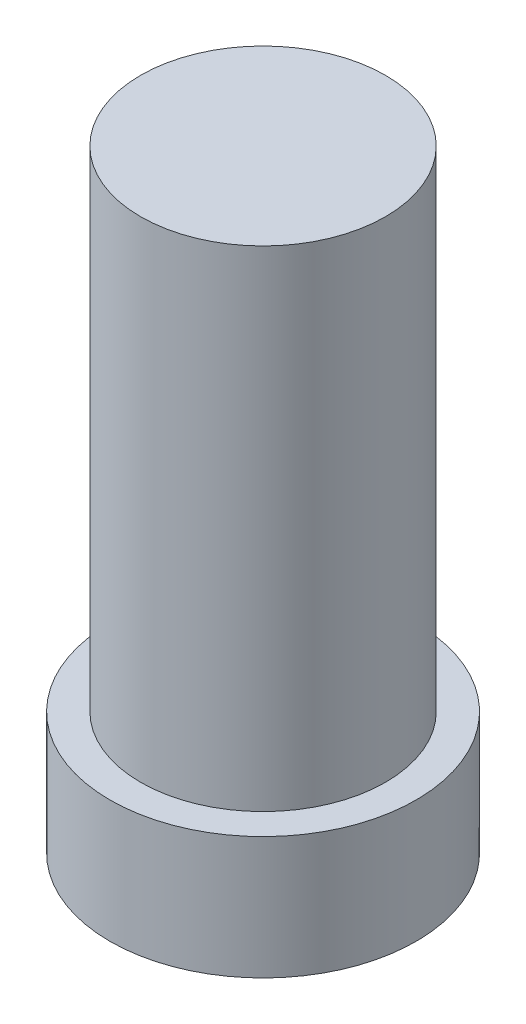
ISO-10303-21;
HEADER;
FILE_DESCRIPTION(('STEP AP214'),'2;1');
FILE_NAME('part.step','',(''),(''),'','','');
FILE_SCHEMA(('AUTOMOTIVE_DESIGN { 1 0 10303 214 1 1 1 1 }'));
ENDSEC;
DATA;
#1=APPLICATION_CONTEXT('core data for automotive mechanical design processes');
#2=APPLICATION_PROTOCOL_DEFINITION('international standard','automotive_design',2000,#1);
#3=PRODUCT_CONTEXT('',#1,'mechanical');
#4=PRODUCT('Part','Part','',(#3));
#5=PRODUCT_RELATED_PRODUCT_CATEGORY('part','',(#4));
#6=PRODUCT_DEFINITION_FORMATION('','',#4);
#7=PRODUCT_DEFINITION_CONTEXT('part definition',#1,'design');
#8=PRODUCT_DEFINITION('design','',#6,#7);
#9=PRODUCT_DEFINITION_SHAPE('','',#8);
#10=(LENGTH_UNIT() NAMED_UNIT(*) SI_UNIT(.MILLI.,.METRE.));
#11=(NAMED_UNIT(*) PLANE_ANGLE_UNIT() SI_UNIT($,.RADIAN.));
#12=(NAMED_UNIT(*) SI_UNIT($,.STERADIAN.) SOLID_ANGLE_UNIT());
#13=UNCERTAINTY_MEASURE_WITH_UNIT(LENGTH_MEASURE(1.E-05),#10,'distance_accuracy_value','');
#14=(GEOMETRIC_REPRESENTATION_CONTEXT(3) GLOBAL_UNCERTAINTY_ASSIGNED_CONTEXT((#13)) GLOBAL_UNIT_ASSIGNED_CONTEXT((#10,
#11,#12)) REPRESENTATION_CONTEXT('',''));
#15=CARTESIAN_POINT('',(0.,0.,0.));
#16=DIRECTION('',(0.,0.,1.));
#17=DIRECTION('',(1.,0.,0.));
#18=AXIS2_PLACEMENT_3D('',#15,#16,#17);
#19=CARTESIAN_POINT('',(0.,4.01151685393258,0.));
#20=DIRECTION('',(0.,-1.,0.));
#21=DIRECTION('',(0.,0.,-1.));
#22=AXIS2_PLACEMENT_3D('',#19,#20,#21);
#23=CYLINDRICAL_SURFACE('',#22,0.5625);
#24=CARTESIAN_POINT('',(0.,4.01151685393258,0.));
#25=DIRECTION('',(0.,1.,0.));
#26=DIRECTION('',(0.,0.,1.));
#27=AXIS2_PLACEMENT_3D('',#24,#25,#26);
#28=CIRCLE('',#27,0.5625);
#29=CARTESIAN_POINT('',(0.,4.01151685393258,0.5625));
#30=VERTEX_POINT('',#29);
#31=EDGE_CURVE('E46',#30,#30,#28,.T.);
#32=ORIENTED_EDGE('',*,*,#31,.F.);
#33=EDGE_LOOP('',(#32));
#34=FACE_BOUND('',#33,.T.);
#35=CARTESIAN_POINT('',(0.,3.56151685393258,0.));
#36=DIRECTION('',(0.,1.,0.));
#37=DIRECTION('',(0.,0.,1.));
#38=AXIS2_PLACEMENT_3D('',#35,#36,#37);
#39=CIRCLE('',#38,0.5625);
#40=CARTESIAN_POINT('',(0.,3.56151685393258,0.5625));
#41=VERTEX_POINT('',#40);
#42=EDGE_CURVE('E41',#41,#41,#39,.T.);
#43=ORIENTED_EDGE('',*,*,#42,.T.);
#44=EDGE_LOOP('',(#43));
#45=FACE_BOUND('',#44,.T.);
#46=ADVANCED_FACE('F38',(#34,#45),#23,.T.);
#47=CARTESIAN_POINT('',(0.,4.01151685393258,0.));
#48=DIRECTION('',(0.,1.,0.));
#49=DIRECTION('',(0.,0.,1.));
#50=AXIS2_PLACEMENT_3D('',#47,#48,#49);
#51=PLANE('',#50);
#52=CARTESIAN_POINT('',(0.,4.01151685393258,0.));
#53=DIRECTION('',(0.,1.,0.));
#54=DIRECTION('',(0.,0.,1.));
#55=AXIS2_PLACEMENT_3D('',#52,#53,#54);
#56=CIRCLE('',#55,0.45);
#57=CARTESIAN_POINT('',(0.,4.01151685393258,0.45));
#58=VERTEX_POINT('',#57);
#59=EDGE_CURVE('E10',#58,#58,#56,.T.);
#60=ORIENTED_EDGE('',*,*,#59,.F.);
#61=EDGE_LOOP('',(#60));
#62=FACE_BOUND('',#61,.T.);
#63=ORIENTED_EDGE('',*,*,#31,.T.);
#64=EDGE_LOOP('',(#63));
#65=FACE_BOUND('',#64,.T.);
#66=ADVANCED_FACE('F66',(#62,#65),#51,.T.);
#67=CARTESIAN_POINT('',(0.,3.56151685393258,0.));
#68=DIRECTION('',(0.,1.,0.));
#69=DIRECTION('',(0.,0.,1.));
#70=AXIS2_PLACEMENT_3D('',#67,#68,#69);
#71=PLANE('',#70);
#72=ORIENTED_EDGE('',*,*,#42,.F.);
#73=EDGE_LOOP('',(#72));
#74=FACE_BOUND('',#73,.T.);
#75=ADVANCED_FACE('F63',(#74),#71,.F.);
#76=CARTESIAN_POINT('',(0.,5.81151685393258,0.));
#77=DIRECTION('',(0.,-1.,0.));
#78=DIRECTION('',(0.,0.,-1.));
#79=AXIS2_PLACEMENT_3D('',#76,#77,#78);
#80=CYLINDRICAL_SURFACE('',#79,0.45);
#81=CARTESIAN_POINT('',(0.,5.81151685393258,0.));
#82=DIRECTION('',(0.,1.,0.));
#83=DIRECTION('',(0.,0.,1.));
#84=AXIS2_PLACEMENT_3D('',#81,#82,#83);
#85=CIRCLE('',#84,0.45);
#86=CARTESIAN_POINT('',(0.,5.81151685393258,0.45));
#87=VERTEX_POINT('',#86);
#88=EDGE_CURVE('E53',#87,#87,#85,.T.);
#89=ORIENTED_EDGE('',*,*,#88,.F.);
#90=EDGE_LOOP('',(#89));
#91=FACE_BOUND('',#90,.T.);
#92=ORIENTED_EDGE('',*,*,#59,.T.);
#93=EDGE_LOOP('',(#92));
#94=FACE_BOUND('',#93,.T.);
#95=ADVANCED_FACE('F65',(#91,#94),#80,.T.);
#96=CARTESIAN_POINT('',(0.,5.81151685393258,0.));
#97=DIRECTION('',(0.,1.,0.));
#98=DIRECTION('',(0.,0.,1.));
#99=AXIS2_PLACEMENT_3D('',#96,#97,#98);
#100=PLANE('',#99);
#101=ORIENTED_EDGE('',*,*,#88,.T.);
#102=EDGE_LOOP('',(#101));
#103=FACE_BOUND('',#102,.T.);
#104=ADVANCED_FACE('F71',(#103),#100,.T.);
#105=CLOSED_SHELL('',(#46,#66,#75,#95,#104));
#106=MANIFOLD_SOLID_BREP('B2',#105);
#107=ADVANCED_BREP_SHAPE_REPRESENTATION('',(#18,#106),#14);
#108=SHAPE_DEFINITION_REPRESENTATION(#9,#107);
ENDSEC;
END-ISO-10303-21;
